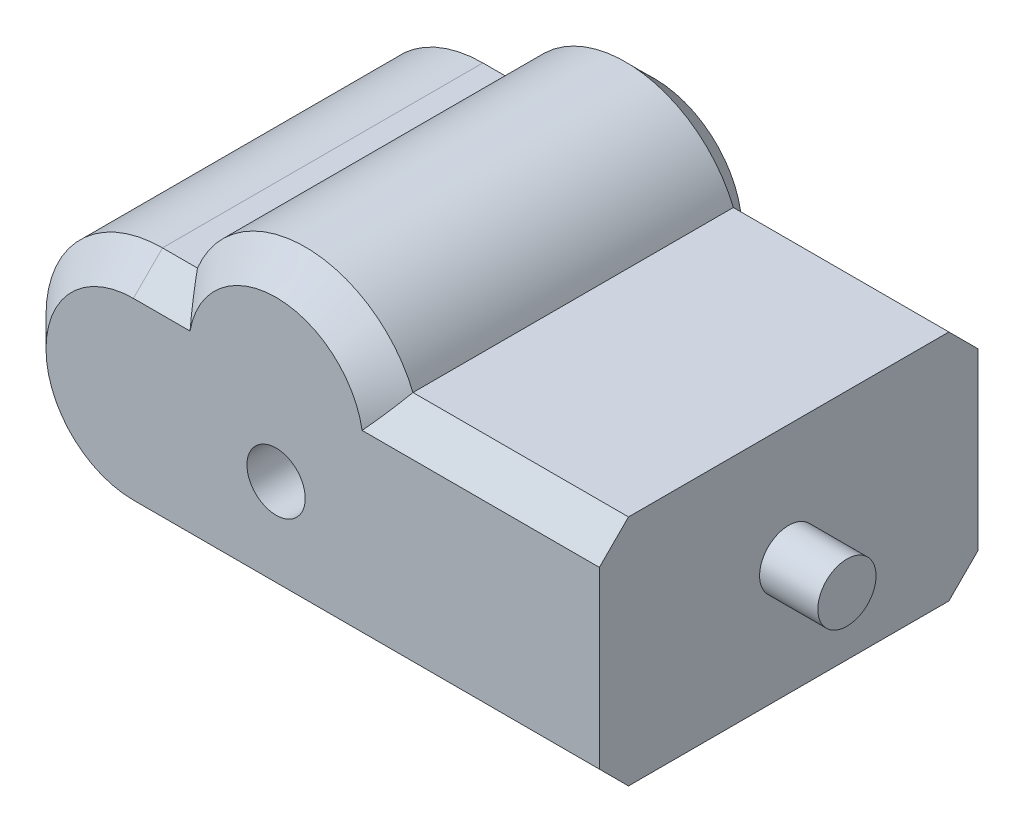
ISO-10303-21;
HEADER;
FILE_DESCRIPTION(('STEP AP214'),'2;1');
FILE_NAME('part.step','',(''),(''),'','','');
FILE_SCHEMA(('AUTOMOTIVE_DESIGN { 1 0 10303 214 1 1 1 1 }'));
ENDSEC;
DATA;
#1=APPLICATION_CONTEXT('core data for automotive mechanical design processes');
#2=APPLICATION_PROTOCOL_DEFINITION('international standard','automotive_design',2000,#1);
#3=PRODUCT_CONTEXT('',#1,'mechanical');
#4=PRODUCT('Part','Part','',(#3));
#5=PRODUCT_RELATED_PRODUCT_CATEGORY('part','',(#4));
#6=PRODUCT_DEFINITION_FORMATION('','',#4);
#7=PRODUCT_DEFINITION_CONTEXT('part definition',#1,'design');
#8=PRODUCT_DEFINITION('design','',#6,#7);
#9=PRODUCT_DEFINITION_SHAPE('','',#8);
#10=(LENGTH_UNIT() NAMED_UNIT(*) SI_UNIT(.MILLI.,.METRE.));
#11=(NAMED_UNIT(*) PLANE_ANGLE_UNIT() SI_UNIT($,.RADIAN.));
#12=(NAMED_UNIT(*) SI_UNIT($,.STERADIAN.) SOLID_ANGLE_UNIT());
#13=UNCERTAINTY_MEASURE_WITH_UNIT(LENGTH_MEASURE(1.E-05),#10,'distance_accuracy_value','');
#14=(GEOMETRIC_REPRESENTATION_CONTEXT(3) GLOBAL_UNCERTAINTY_ASSIGNED_CONTEXT((#13)) GLOBAL_UNIT_ASSIGNED_CONTEXT((#10,
#11,#12)) REPRESENTATION_CONTEXT('',''));
#15=CARTESIAN_POINT('',(0.,0.,0.));
#16=DIRECTION('',(0.,0.,1.));
#17=DIRECTION('',(1.,0.,0.));
#18=AXIS2_PLACEMENT_3D('',#15,#16,#17);
#19=CARTESIAN_POINT('',(-32.5714285714286,-20.,32.5));
#20=DIRECTION('',(0.,0.,-1.));
#21=DIRECTION('',(-1.,0.,0.));
#22=AXIS2_PLACEMENT_3D('',#19,#20,#21);
#23=CYLINDRICAL_SURFACE('',#22,20.);
#24=DIRECTION('',(0.,0.,-1.));
#25=VECTOR('',#24,1.);
#26=CARTESIAN_POINT('',(-32.5714285714286,0.,32.5));
#27=LINE('',#26,#25);
#28=CARTESIAN_POINT('',(-32.5714285714286,0.,27.5));
#29=VERTEX_POINT('',#28);
#30=CARTESIAN_POINT('',(-32.5714285714286,0.,-27.5));
#31=VERTEX_POINT('',#30);
#32=EDGE_CURVE('E303',#29,#31,#27,.T.);
#33=ORIENTED_EDGE('',*,*,#32,.T.);
#34=CARTESIAN_POINT('',(-32.5714285714286,-20.,-27.5));
#35=DIRECTION('',(0.,0.,-1.));
#36=DIRECTION('',(-1.,0.,0.));
#37=AXIS2_PLACEMENT_3D('',#34,#35,#36);
#38=CIRCLE('',#37,20.);
#39=CARTESIAN_POINT('',(-32.5714285714286,-40.,-27.5));
#40=VERTEX_POINT('',#39);
#41=EDGE_CURVE('E176',#31,#40,#38,.F.);
#42=ORIENTED_EDGE('',*,*,#41,.T.);
#43=DIRECTION('',(0.,0.,-1.));
#44=VECTOR('',#43,1.);
#45=CARTESIAN_POINT('',(-32.5714285714286,-40.,32.5));
#46=LINE('',#45,#44);
#47=CARTESIAN_POINT('',(-32.5714285714286,-40.,27.5));
#48=VERTEX_POINT('',#47);
#49=EDGE_CURVE('E150',#48,#40,#46,.T.);
#50=ORIENTED_EDGE('',*,*,#49,.F.);
#51=CARTESIAN_POINT('',(-32.5714285714286,-20.,27.5));
#52=DIRECTION('',(0.,0.,-1.));
#53=DIRECTION('',(-1.,0.,0.));
#54=AXIS2_PLACEMENT_3D('',#51,#52,#53);
#55=CIRCLE('',#54,20.);
#56=EDGE_CURVE('E174',#48,#29,#55,.T.);
#57=ORIENTED_EDGE('',*,*,#56,.T.);
#58=EDGE_LOOP('',(#33,#42,#50,#57));
#59=FACE_BOUND('',#58,.T.);
#60=ADVANCED_FACE('F39',(#59),#23,.T.);
#61=CARTESIAN_POINT('',(47.4285714285714,-40.,32.5));
#62=DIRECTION('',(0.,1.,0.));
#63=DIRECTION('',(-1.,0.,0.));
#64=AXIS2_PLACEMENT_3D('',#61,#62,#63);
#65=PLANE('',#64);
#66=ORIENTED_EDGE('',*,*,#49,.T.);
#67=DIRECTION('',(1.,0.,0.));
#68=VECTOR('',#67,1.);
#69=CARTESIAN_POINT('',(47.4285714285714,-40.,-27.5));
#70=LINE('',#69,#68);
#71=CARTESIAN_POINT('',(47.4285714285714,-40.,-27.5));
#72=VERTEX_POINT('',#71);
#73=EDGE_CURVE('E149',#40,#72,#70,.T.);
#74=ORIENTED_EDGE('',*,*,#73,.T.);
#75=DIRECTION('',(0.,0.,-1.));
#76=VECTOR('',#75,1.);
#77=CARTESIAN_POINT('',(47.4285714285714,-40.,32.5));
#78=LINE('',#77,#76);
#79=CARTESIAN_POINT('',(47.4285714285714,-40.,27.5));
#80=VERTEX_POINT('',#79);
#81=EDGE_CURVE('E133',#80,#72,#78,.T.);
#82=ORIENTED_EDGE('',*,*,#81,.F.);
#83=DIRECTION('',(-1.,0.,0.));
#84=VECTOR('',#83,1.);
#85=CARTESIAN_POINT('',(47.4285714285714,-40.,27.5));
#86=LINE('',#85,#84);
#87=EDGE_CURVE('E146',#80,#48,#86,.T.);
#88=ORIENTED_EDGE('',*,*,#87,.T.);
#89=EDGE_LOOP('',(#66,#74,#82,#88));
#90=FACE_BOUND('',#89,.T.);
#91=ADVANCED_FACE('F145',(#90),#65,.F.);
#92=CARTESIAN_POINT('',(47.4285714285713,0.,32.5));
#93=DIRECTION('',(-1.,0.,0.));
#94=DIRECTION('',(0.,-1.,0.));
#95=AXIS2_PLACEMENT_3D('',#92,#93,#94);
#96=PLANE('',#95);
#97=CARTESIAN_POINT('',(47.4285714285713,-20.,0.));
#98=DIRECTION('',(-1.,0.,0.));
#99=DIRECTION('',(0.,-1.,0.));
#100=AXIS2_PLACEMENT_3D('',#97,#98,#99);
#101=CIRCLE('',#100,5.);
#102=CARTESIAN_POINT('',(47.4285714285713,-25.,0.));
#103=VERTEX_POINT('',#102);
#104=EDGE_CURVE('E11',#103,#103,#101,.F.);
#105=ORIENTED_EDGE('',*,*,#104,.F.);
#106=EDGE_LOOP('',(#105));
#107=FACE_BOUND('',#106,.T.);
#108=ORIENTED_EDGE('',*,*,#81,.T.);
#109=DIRECTION('',(0.,0.70710678118655,-0.707106781186546));
#110=VECTOR('',#109,1.);
#111=CARTESIAN_POINT('',(47.4285714285714,-40.,-27.5));
#112=LINE('',#111,#110);
#113=CARTESIAN_POINT('',(47.4285714285714,-35.,-32.5));
#114=VERTEX_POINT('',#113);
#115=EDGE_CURVE('E162',#72,#114,#112,.T.);
#116=ORIENTED_EDGE('',*,*,#115,.T.);
#117=DIRECTION('',(0.,1.,0.));
#118=VECTOR('',#117,1.);
#119=CARTESIAN_POINT('',(47.4285714285713,0.,-32.5));
#120=LINE('',#119,#118);
#121=CARTESIAN_POINT('',(47.4285714285713,-5.00000000000002,-32.5));
#122=VERTEX_POINT('',#121);
#123=EDGE_CURVE('E306',#114,#122,#120,.T.);
#124=ORIENTED_EDGE('',*,*,#123,.T.);
#125=DIRECTION('',(0.,0.70710678118655,0.707106781186546));
#126=VECTOR('',#125,1.);
#127=CARTESIAN_POINT('',(47.4285714285713,0.,-27.5));
#128=LINE('',#127,#126);
#129=CARTESIAN_POINT('',(47.4285714285713,0.,-27.5));
#130=VERTEX_POINT('',#129);
#131=EDGE_CURVE('E139',#122,#130,#128,.T.);
#132=ORIENTED_EDGE('',*,*,#131,.T.);
#133=DIRECTION('',(0.,0.,-1.));
#134=VECTOR('',#133,1.);
#135=CARTESIAN_POINT('',(47.4285714285713,0.,32.5));
#136=LINE('',#135,#134);
#137=CARTESIAN_POINT('',(47.4285714285713,0.,27.5));
#138=VERTEX_POINT('',#137);
#139=EDGE_CURVE('E151',#138,#130,#136,.T.);
#140=ORIENTED_EDGE('',*,*,#139,.F.);
#141=DIRECTION('',(0.,0.707106781186546,-0.707106781186549));
#142=VECTOR('',#141,1.);
#143=CARTESIAN_POINT('',(47.4285714285713,-4.99999999999999,32.5));
#144=LINE('',#143,#142);
#145=CARTESIAN_POINT('',(47.4285714285713,-5.,32.5));
#146=VERTEX_POINT('',#145);
#147=EDGE_CURVE('E140',#138,#146,#144,.F.);
#148=ORIENTED_EDGE('',*,*,#147,.T.);
#149=DIRECTION('',(0.,1.,0.));
#150=VECTOR('',#149,1.);
#151=CARTESIAN_POINT('',(47.4285714285713,0.,32.5));
#152=LINE('',#151,#150);
#153=CARTESIAN_POINT('',(47.4285714285714,-35.,32.5));
#154=VERTEX_POINT('',#153);
#155=EDGE_CURVE('E135',#154,#146,#152,.T.);
#156=ORIENTED_EDGE('',*,*,#155,.F.);
#157=DIRECTION('',(0.,0.707106781186546,0.707106781186549));
#158=VECTOR('',#157,1.);
#159=CARTESIAN_POINT('',(47.4285714285714,-35.,32.5));
#160=LINE('',#159,#158);
#161=EDGE_CURVE('E130',#154,#80,#160,.F.);
#162=ORIENTED_EDGE('',*,*,#161,.T.);
#163=EDGE_LOOP('',(#108,#116,#124,#132,#140,#148,#156,#162));
#164=FACE_BOUND('',#163,.T.);
#165=ADVANCED_FACE('F132',(#107,#164),#96,.F.);
#166=CARTESIAN_POINT('',(10.4285714285713,0.,32.5));
#167=DIRECTION('',(0.,-1.,0.));
#168=DIRECTION('',(0.,0.,-1.));
#169=AXIS2_PLACEMENT_3D('',#166,#167,#168);
#170=PLANE('',#169);
#171=ORIENTED_EDGE('',*,*,#139,.T.);
#172=DIRECTION('',(-1.,0.,0.));
#173=VECTOR('',#172,1.);
#174=CARTESIAN_POINT('',(10.4285714285713,0.,-27.5));
#175=LINE('',#174,#173);
#176=CARTESIAN_POINT('',(10.4285714285713,0.,-27.5));
#177=VERTEX_POINT('',#176);
#178=EDGE_CURVE('E188',#130,#177,#175,.T.);
#179=ORIENTED_EDGE('',*,*,#178,.T.);
#180=DIRECTION('',(0.,0.,-1.));
#181=VECTOR('',#180,1.);
#182=CARTESIAN_POINT('',(10.4285714285713,0.,32.5));
#183=LINE('',#182,#181);
#184=CARTESIAN_POINT('',(10.4285714285713,0.,27.5));
#185=VERTEX_POINT('',#184);
#186=EDGE_CURVE('E294',#185,#177,#183,.T.);
#187=ORIENTED_EDGE('',*,*,#186,.F.);
#188=DIRECTION('',(1.,0.,0.));
#189=VECTOR('',#188,1.);
#190=CARTESIAN_POINT('',(10.4285714285713,0.,27.5));
#191=LINE('',#190,#189);
#192=EDGE_CURVE('E186',#185,#138,#191,.T.);
#193=ORIENTED_EDGE('',*,*,#192,.T.);
#194=EDGE_LOOP('',(#171,#179,#187,#193));
#195=FACE_BOUND('',#194,.T.);
#196=ADVANCED_FACE('F291',(#195),#170,.F.);
#197=CARTESIAN_POINT('',(-8.07142857142866,-7.59934207678534,32.5));
#198=DIRECTION('',(0.,0.,-1.));
#199=DIRECTION('',(-1.,0.,0.));
#200=AXIS2_PLACEMENT_3D('',#197,#198,#199);
#201=CYLINDRICAL_SURFACE('',#200,20.);
#202=ORIENTED_EDGE('',*,*,#186,.T.);
#203=CARTESIAN_POINT('',(-8.07142857142866,-7.59934207678534,-27.5));
#204=DIRECTION('',(0.,0.,-1.));
#205=DIRECTION('',(-1.,0.,0.));
#206=AXIS2_PLACEMENT_3D('',#203,#204,#205);
#207=CIRCLE('',#206,20.);
#208=CARTESIAN_POINT('',(-26.5714285714287,0.,-27.5));
#209=VERTEX_POINT('',#208);
#210=EDGE_CURVE('E184',#177,#209,#207,.F.);
#211=ORIENTED_EDGE('',*,*,#210,.T.);
#212=DIRECTION('',(0.,0.,-1.));
#213=VECTOR('',#212,1.);
#214=CARTESIAN_POINT('',(-26.5714285714287,0.,32.5));
#215=LINE('',#214,#213);
#216=CARTESIAN_POINT('',(-26.5714285714287,0.,27.5));
#217=VERTEX_POINT('',#216);
#218=EDGE_CURVE('E298',#217,#209,#215,.T.);
#219=ORIENTED_EDGE('',*,*,#218,.F.);
#220=CARTESIAN_POINT('',(-8.07142857142866,-7.59934207678534,27.5));
#221=DIRECTION('',(0.,0.,-1.));
#222=DIRECTION('',(-1.,0.,0.));
#223=AXIS2_PLACEMENT_3D('',#220,#221,#222);
#224=CIRCLE('',#223,20.);
#225=EDGE_CURVE('E182',#217,#185,#224,.T.);
#226=ORIENTED_EDGE('',*,*,#225,.T.);
#227=EDGE_LOOP('',(#202,#211,#219,#226));
#228=FACE_BOUND('',#227,.T.);
#229=ADVANCED_FACE('F335',(#228),#201,.T.);
#230=CARTESIAN_POINT('',(-32.5714285714286,0.,32.5));
#231=DIRECTION('',(0.,-1.,0.));
#232=DIRECTION('',(0.,0.,-1.));
#233=AXIS2_PLACEMENT_3D('',#230,#231,#232);
#234=PLANE('',#233);
#235=ORIENTED_EDGE('',*,*,#218,.T.);
#236=DIRECTION('',(-1.,0.,0.));
#237=VECTOR('',#236,1.);
#238=CARTESIAN_POINT('',(-32.5714285714286,0.,-27.5));
#239=LINE('',#238,#237);
#240=EDGE_CURVE('E180',#209,#31,#239,.T.);
#241=ORIENTED_EDGE('',*,*,#240,.T.);
#242=ORIENTED_EDGE('',*,*,#32,.F.);
#243=DIRECTION('',(1.,0.,0.));
#244=VECTOR('',#243,1.);
#245=CARTESIAN_POINT('',(-32.5714285714286,0.,27.5));
#246=LINE('',#245,#244);
#247=EDGE_CURVE('E178',#29,#217,#246,.T.);
#248=ORIENTED_EDGE('',*,*,#247,.T.);
#249=EDGE_LOOP('',(#235,#241,#242,#248));
#250=FACE_BOUND('',#249,.T.);
#251=ADVANCED_FACE('F379',(#250),#234,.F.);
#252=CARTESIAN_POINT('',(-32.5714285714286,-20.,32.5));
#253=DIRECTION('',(0.,0.,-1.));
#254=DIRECTION('',(-1.,0.,0.));
#255=AXIS2_PLACEMENT_3D('',#252,#253,#254);
#256=PLANE('',#255);
#257=CARTESIAN_POINT('',(-8.07142857142866,-20.,32.5));
#258=DIRECTION('',(0.,0.,1.));
#259=DIRECTION('',(1.,0.,0.));
#260=AXIS2_PLACEMENT_3D('',#257,#258,#259);
#261=CIRCLE('',#260,5.);
#262=CARTESIAN_POINT('',(-3.07142857142866,-20.,32.5));
#263=VERTEX_POINT('',#262);
#264=EDGE_CURVE('E309',#263,#263,#261,.T.);
#265=ORIENTED_EDGE('',*,*,#264,.F.);
#266=EDGE_LOOP('',(#265));
#267=FACE_BOUND('',#266,.T.);
#268=CARTESIAN_POINT('',(-32.5714285714286,-20.,32.5));
#269=DIRECTION('',(0.,0.,-1.));
#270=DIRECTION('',(-1.,0.,0.));
#271=AXIS2_PLACEMENT_3D('',#268,#269,#270);
#272=CIRCLE('',#271,15.);
#273=CARTESIAN_POINT('',(-32.5714285714286,-5.,32.5));
#274=VERTEX_POINT('',#273);
#275=CARTESIAN_POINT('',(-32.5714285714286,-35.,32.5));
#276=VERTEX_POINT('',#275);
#277=EDGE_CURVE('E56',#274,#276,#272,.F.);
#278=ORIENTED_EDGE('',*,*,#277,.T.);
#279=DIRECTION('',(1.,0.,0.));
#280=VECTOR('',#279,1.);
#281=CARTESIAN_POINT('',(-32.5714285714286,-35.,32.5));
#282=LINE('',#281,#280);
#283=EDGE_CURVE('E49',#276,#154,#282,.T.);
#284=ORIENTED_EDGE('',*,*,#283,.T.);
#285=ORIENTED_EDGE('',*,*,#155,.T.);
#286=DIRECTION('',(-1.,0.,0.));
#287=VECTOR('',#286,1.);
#288=CARTESIAN_POINT('',(-32.5714285714286,-5.,32.5));
#289=LINE('',#288,#287);
#290=CARTESIAN_POINT('',(6.70163545631634,-5.,32.5));
#291=VERTEX_POINT('',#290);
#292=EDGE_CURVE('E190',#146,#291,#289,.T.);
#293=ORIENTED_EDGE('',*,*,#292,.T.);
#294=CARTESIAN_POINT('',(-8.07142857142866,-7.59934207678534,32.5));
#295=DIRECTION('',(0.,0.,-1.));
#296=DIRECTION('',(-1.,0.,0.));
#297=AXIS2_PLACEMENT_3D('',#294,#295,#296);
#298=CIRCLE('',#297,15.);
#299=CARTESIAN_POINT('',(-22.8444925991737,-5.,32.5));
#300=VERTEX_POINT('',#299);
#301=EDGE_CURVE('E192',#291,#300,#298,.F.);
#302=ORIENTED_EDGE('',*,*,#301,.T.);
#303=DIRECTION('',(-1.,0.,0.));
#304=VECTOR('',#303,1.);
#305=CARTESIAN_POINT('',(-32.5714285714286,-5.,32.5));
#306=LINE('',#305,#304);
#307=EDGE_CURVE('E61',#300,#274,#306,.T.);
#308=ORIENTED_EDGE('',*,*,#307,.T.);
#309=EDGE_LOOP('',(#278,#284,#285,#293,#302,#308));
#310=FACE_BOUND('',#309,.T.);
#311=ADVANCED_FACE('F384',(#267,#310),#256,.F.);
#312=CARTESIAN_POINT('',(-32.5714285714286,-20.,-32.5));
#313=DIRECTION('',(0.,0.,-1.));
#314=DIRECTION('',(-1.,0.,0.));
#315=AXIS2_PLACEMENT_3D('',#312,#313,#314);
#316=PLANE('',#315);
#317=ORIENTED_EDGE('',*,*,#123,.F.);
#318=DIRECTION('',(-1.,0.,0.));
#319=VECTOR('',#318,1.);
#320=CARTESIAN_POINT('',(-32.5714285714286,-35.,-32.5));
#321=LINE('',#320,#319);
#322=CARTESIAN_POINT('',(-32.5714285714286,-35.,-32.5));
#323=VERTEX_POINT('',#322);
#324=EDGE_CURVE('E172',#114,#323,#321,.T.);
#325=ORIENTED_EDGE('',*,*,#324,.T.);
#326=CARTESIAN_POINT('',(-32.5714285714286,-20.,-32.5));
#327=DIRECTION('',(0.,0.,-1.));
#328=DIRECTION('',(-1.,0.,0.));
#329=AXIS2_PLACEMENT_3D('',#326,#327,#328);
#330=CIRCLE('',#329,15.);
#331=CARTESIAN_POINT('',(-32.5714285714286,-5.00000000000002,-32.5));
#332=VERTEX_POINT('',#331);
#333=EDGE_CURVE('E170',#323,#332,#330,.T.);
#334=ORIENTED_EDGE('',*,*,#333,.T.);
#335=DIRECTION('',(1.,0.,0.));
#336=VECTOR('',#335,1.);
#337=CARTESIAN_POINT('',(-26.5714285714287,-5.00000000000002,-32.5));
#338=LINE('',#337,#336);
#339=CARTESIAN_POINT('',(-22.8444925991736,-5.00000000000002,-32.5));
#340=VERTEX_POINT('',#339);
#341=EDGE_CURVE('E168',#332,#340,#338,.T.);
#342=ORIENTED_EDGE('',*,*,#341,.T.);
#343=CARTESIAN_POINT('',(-8.07142857142866,-7.59934207678534,-32.5));
#344=DIRECTION('',(0.,0.,-1.));
#345=DIRECTION('',(-1.,0.,0.));
#346=AXIS2_PLACEMENT_3D('',#343,#344,#345);
#347=CIRCLE('',#346,15.);
#348=CARTESIAN_POINT('',(6.70163545631633,-5.00000000000002,-32.5));
#349=VERTEX_POINT('',#348);
#350=EDGE_CURVE('E166',#340,#349,#347,.T.);
#351=ORIENTED_EDGE('',*,*,#350,.T.);
#352=DIRECTION('',(1.,0.,0.));
#353=VECTOR('',#352,1.);
#354=CARTESIAN_POINT('',(47.4285714285713,-5.00000000000002,-32.5));
#355=LINE('',#354,#353);
#356=EDGE_CURVE('E164',#349,#122,#355,.T.);
#357=ORIENTED_EDGE('',*,*,#356,.T.);
#358=EDGE_LOOP('',(#317,#325,#334,#342,#351,#357));
#359=FACE_BOUND('',#358,.T.);
#360=ADVANCED_FACE('F239',(#359),#316,.T.);
#361=CARTESIAN_POINT('',(10.4285714285713,0.,-27.5));
#362=DIRECTION('',(0.,0.707106781186545,-0.707106781186549));
#363=DIRECTION('',(1.,0.,0.));
#364=AXIS2_PLACEMENT_3D('',#361,#362,#363);
#365=PLANE('',#364);
#366=ORIENTED_EDGE('',*,*,#131,.F.);
#367=ORIENTED_EDGE('',*,*,#356,.F.);
#368=CARTESIAN_POINT('',(6.70163545631633,-5.00000000000002,-32.5));
#369=CARTESIAN_POINT('',(6.87175073423274,-4.79733108961404,-32.297331089614));
#370=CARTESIAN_POINT('',(7.03969955904487,-4.59375977763127,-32.0937597776313));
#371=CARTESIAN_POINT('',(7.37152359386892,-4.18497156014633,-31.6849715601463));
#372=CARTESIAN_POINT('',(7.53539892935427,-3.97975470558904,-31.479754705589));
#373=CARTESIAN_POINT('',(8.02114336002521,-3.36207931086404,-30.862079310864));
#374=CARTESIAN_POINT('',(8.33731491464059,-2.94737566775521,-30.4473756677552));
#375=CARTESIAN_POINT('',(8.95615477671934,-2.113082603135,-29.613082603135));
#376=CARTESIAN_POINT('',(9.25882560388042,-1.69349411189263,-29.1934941118926));
#377=CARTESIAN_POINT('',(9.85229686990586,-0.84985724434936,-28.3498572443494));
#378=CARTESIAN_POINT('',(10.1430909029164,-0.425806612449986,-27.92580661245));
#379=CARTESIAN_POINT('',(10.4285714285713,0.,-27.5));
#380=B_SPLINE_CURVE_WITH_KNOTS('',3,(#368,#369,#370,#371,#372,#373,#374,#375,#376,#377,#378,
#379),.UNSPECIFIED.,.F.,.F.,(4,2,2,2,2,4),(0.,0.999875382109055,1.99971992735593,
3.99832393930759,5.99655336915382,7.99584670012729),.UNSPECIFIED.);
#381=EDGE_CURVE('E213',#177,#349,#380,.F.);
#382=ORIENTED_EDGE('',*,*,#381,.F.);
#383=ORIENTED_EDGE('',*,*,#178,.F.);
#384=EDGE_LOOP('',(#366,#367,#382,#383));
#385=FACE_BOUND('',#384,.T.);
#386=ADVANCED_FACE('F231',(#385),#365,.T.);
#387=CARTESIAN_POINT('',(-8.07142857142866,-7.59934207678534,-27.5));
#388=DIRECTION('',(0.,0.,1.));
#389=DIRECTION('',(1.,0.,0.));
#390=AXIS2_PLACEMENT_3D('',#387,#388,#389);
#391=CONICAL_SURFACE('',#390,20.,0.785398163397451);
#392=ORIENTED_EDGE('',*,*,#381,.T.);
#393=ORIENTED_EDGE('',*,*,#350,.F.);
#394=CARTESIAN_POINT('',(-22.8444925991736,-5.00000000000002,-32.5));
#395=CARTESIAN_POINT('',(-23.0146078770901,-4.79733108961404,-32.297331089614));
#396=CARTESIAN_POINT('',(-23.1825567019022,-4.59375977763127,-32.0937597776313));
#397=CARTESIAN_POINT('',(-23.5143807367262,-4.18497156014633,-31.6849715601463));
#398=CARTESIAN_POINT('',(-23.6782560722116,-3.97975470558904,-31.479754705589));
#399=CARTESIAN_POINT('',(-24.1640005028825,-3.36207931086404,-30.862079310864));
#400=CARTESIAN_POINT('',(-24.4801720574979,-2.94737566775521,-30.4473756677552));
#401=CARTESIAN_POINT('',(-25.0990119195766,-2.113082603135,-29.613082603135));
#402=CARTESIAN_POINT('',(-25.4016827467377,-1.69349411189263,-29.1934941118926));
#403=CARTESIAN_POINT('',(-25.9951540127632,-0.849857244349362,-28.3498572443494));
#404=CARTESIAN_POINT('',(-26.2859480457737,-0.425806612449988,-27.92580661245));
#405=CARTESIAN_POINT('',(-26.5714285714287,0.,-27.5));
#406=B_SPLINE_CURVE_WITH_KNOTS('',3,(#394,#395,#396,#397,#398,#399,#400,#401,#402,#403,#404,
#405),.UNSPECIFIED.,.F.,.F.,(4,2,2,2,2,4),(0.,0.999875382109054,1.99971992735592,
3.99832393930759,5.99655336915381,7.99584670012728),.UNSPECIFIED.);
#407=EDGE_CURVE('E204',#209,#340,#406,.F.);
#408=ORIENTED_EDGE('',*,*,#407,.F.);
#409=ORIENTED_EDGE('',*,*,#210,.F.);
#410=EDGE_LOOP('',(#392,#393,#408,#409));
#411=FACE_BOUND('',#410,.T.);
#412=ADVANCED_FACE('F225',(#411),#391,.T.);
#413=CARTESIAN_POINT('',(-32.5714285714286,0.,-27.5));
#414=DIRECTION('',(0.,0.707106781186545,-0.707106781186549));
#415=DIRECTION('',(1.,0.,0.));
#416=AXIS2_PLACEMENT_3D('',#413,#414,#415);
#417=PLANE('',#416);
#418=ORIENTED_EDGE('',*,*,#407,.T.);
#419=ORIENTED_EDGE('',*,*,#341,.F.);
#420=DIRECTION('',(0.,-0.70710678118655,-0.707106781186545));
#421=VECTOR('',#420,1.);
#422=CARTESIAN_POINT('',(-32.5714285714286,0.,-27.5));
#423=LINE('',#422,#421);
#424=EDGE_CURVE('E200',#31,#332,#423,.T.);
#425=ORIENTED_EDGE('',*,*,#424,.F.);
#426=ORIENTED_EDGE('',*,*,#240,.F.);
#427=EDGE_LOOP('',(#418,#419,#425,#426));
#428=FACE_BOUND('',#427,.T.);
#429=ADVANCED_FACE('F221',(#428),#417,.T.);
#430=CARTESIAN_POINT('',(-32.5714285714286,-20.,-27.5));
#431=DIRECTION('',(0.,0.,1.));
#432=DIRECTION('',(1.,0.,0.));
#433=AXIS2_PLACEMENT_3D('',#430,#431,#432);
#434=CONICAL_SURFACE('',#433,20.,0.785398163397451);
#435=ORIENTED_EDGE('',*,*,#424,.T.);
#436=ORIENTED_EDGE('',*,*,#333,.F.);
#437=DIRECTION('',(0.,0.707106781186549,-0.707106781186545));
#438=VECTOR('',#437,1.);
#439=CARTESIAN_POINT('',(-32.5714285714286,-40.,-27.5));
#440=LINE('',#439,#438);
#441=EDGE_CURVE('E197',#40,#323,#440,.T.);
#442=ORIENTED_EDGE('',*,*,#441,.F.);
#443=ORIENTED_EDGE('',*,*,#41,.F.);
#444=EDGE_LOOP('',(#435,#436,#442,#443));
#445=FACE_BOUND('',#444,.T.);
#446=ADVANCED_FACE('F351',(#445),#434,.T.);
#447=CARTESIAN_POINT('',(47.4285714285714,-40.,-27.5));
#448=DIRECTION('',(0.,-0.707106781186545,-0.707106781186549));
#449=DIRECTION('',(-1.,0.,0.));
#450=AXIS2_PLACEMENT_3D('',#447,#448,#449);
#451=PLANE('',#450);
#452=ORIENTED_EDGE('',*,*,#441,.T.);
#453=ORIENTED_EDGE('',*,*,#324,.F.);
#454=ORIENTED_EDGE('',*,*,#115,.F.);
#455=ORIENTED_EDGE('',*,*,#73,.F.);
#456=EDGE_LOOP('',(#452,#453,#454,#455));
#457=FACE_BOUND('',#456,.T.);
#458=ADVANCED_FACE('F346',(#457),#451,.T.);
#459=CARTESIAN_POINT('',(-32.5714285714286,-5.,32.5));
#460=DIRECTION('',(0.,-0.707106781186549,-0.707106781186545));
#461=DIRECTION('',(-1.,0.,0.));
#462=AXIS2_PLACEMENT_3D('',#459,#460,#461);
#463=PLANE('',#462);
#464=ORIENTED_EDGE('',*,*,#147,.F.);
#465=ORIENTED_EDGE('',*,*,#192,.F.);
#466=CARTESIAN_POINT('',(10.4285714285713,0.,27.5));
#467=CARTESIAN_POINT('',(10.1430909029164,-0.425806612449984,27.92580661245));
#468=CARTESIAN_POINT('',(9.85229686990587,-0.849857244349357,28.3498572443493));
#469=CARTESIAN_POINT('',(9.25882560388042,-1.69349411189263,29.1934941118926));
#470=CARTESIAN_POINT('',(8.95615477671934,-2.113082603135,29.613082603135));
#471=CARTESIAN_POINT('',(8.33731491464059,-2.9473756677552,30.4473756677552));
#472=CARTESIAN_POINT('',(8.02114336002522,-3.36207931086403,30.862079310864));
#473=CARTESIAN_POINT('',(7.53539892935427,-3.97975470558903,31.479754705589));
#474=CARTESIAN_POINT('',(7.37152359386893,-4.18497156014632,31.6849715601463));
#475=CARTESIAN_POINT('',(7.03969955904487,-4.59375977763126,32.0937597776313));
#476=CARTESIAN_POINT('',(6.87175073423275,-4.79733108961402,32.297331089614));
#477=CARTESIAN_POINT('',(6.70163545631634,-5.00000000000001,32.5));
#478=B_SPLINE_CURVE_WITH_KNOTS('',3,(#466,#467,#468,#469,#470,#471,#472,#473,#474,#475,#476,
#477),.UNSPECIFIED.,.F.,.F.,(4,2,2,2,2,4),(0.,1.99929333097347,3.9975227608197,5.99612677277137,
6.99597131801824,7.9958467001273),.UNSPECIFIED.);
#479=EDGE_CURVE('E201',#291,#185,#478,.F.);
#480=ORIENTED_EDGE('',*,*,#479,.F.);
#481=ORIENTED_EDGE('',*,*,#292,.F.);
#482=EDGE_LOOP('',(#464,#465,#480,#481));
#483=FACE_BOUND('',#482,.T.);
#484=ADVANCED_FACE('F42',(#483),#463,.F.);
#485=CARTESIAN_POINT('',(-8.07142857142866,-7.59934207678534,32.5));
#486=DIRECTION('',(0.,0.,-1.));
#487=DIRECTION('',(-1.,0.,0.));
#488=AXIS2_PLACEMENT_3D('',#485,#486,#487);
#489=CONICAL_SURFACE('',#488,15.,0.785398163397446);
#490=ORIENTED_EDGE('',*,*,#479,.T.);
#491=ORIENTED_EDGE('',*,*,#225,.F.);
#492=CARTESIAN_POINT('',(-26.5714285714287,0.,27.5));
#493=CARTESIAN_POINT('',(-26.2859480457737,-0.425806612449985,27.92580661245));
#494=CARTESIAN_POINT('',(-25.9951540127632,-0.849857244349357,28.3498572443493));
#495=CARTESIAN_POINT('',(-25.4016827467377,-1.69349411189263,29.1934941118926));
#496=CARTESIAN_POINT('',(-25.0990119195767,-2.113082603135,29.613082603135));
#497=CARTESIAN_POINT('',(-24.4801720574979,-2.9473756677552,30.4473756677552));
#498=CARTESIAN_POINT('',(-24.1640005028825,-3.36207931086403,30.862079310864));
#499=CARTESIAN_POINT('',(-23.6782560722116,-3.97975470558903,31.479754705589));
#500=CARTESIAN_POINT('',(-23.5143807367262,-4.18497156014632,31.6849715601463));
#501=CARTESIAN_POINT('',(-23.1825567019022,-4.59375977763126,32.0937597776313));
#502=CARTESIAN_POINT('',(-23.0146078770901,-4.79733108961403,32.297331089614));
#503=CARTESIAN_POINT('',(-22.8444925991737,-5.00000000000001,32.5));
#504=B_SPLINE_CURVE_WITH_KNOTS('',3,(#492,#493,#494,#495,#496,#497,#498,#499,#500,#501,#502,
#503),.UNSPECIFIED.,.F.,.F.,(4,2,2,2,2,4),(0.,1.99929333097347,3.9975227608197,5.99612677277137,
6.99597131801824,7.9958467001273),.UNSPECIFIED.);
#505=EDGE_CURVE('E265',#300,#217,#504,.F.);
#506=ORIENTED_EDGE('',*,*,#505,.F.);
#507=ORIENTED_EDGE('',*,*,#301,.F.);
#508=EDGE_LOOP('',(#490,#491,#506,#507));
#509=FACE_BOUND('',#508,.T.);
#510=ADVANCED_FACE('F261',(#509),#489,.T.);
#511=CARTESIAN_POINT('',(-32.5714285714286,-5.,32.5));
#512=DIRECTION('',(0.,-0.707106781186549,-0.707106781186545));
#513=DIRECTION('',(-1.,0.,0.));
#514=AXIS2_PLACEMENT_3D('',#511,#512,#513);
#515=PLANE('',#514);
#516=ORIENTED_EDGE('',*,*,#505,.T.);
#517=ORIENTED_EDGE('',*,*,#247,.F.);
#518=DIRECTION('',(0.,0.707106781186545,-0.707106781186549));
#519=VECTOR('',#518,1.);
#520=CARTESIAN_POINT('',(-32.5714285714286,-5.,32.5));
#521=LINE('',#520,#519);
#522=EDGE_CURVE('E272',#274,#29,#521,.T.);
#523=ORIENTED_EDGE('',*,*,#522,.F.);
#524=ORIENTED_EDGE('',*,*,#307,.F.);
#525=EDGE_LOOP('',(#516,#517,#523,#524));
#526=FACE_BOUND('',#525,.T.);
#527=ADVANCED_FACE('F254',(#526),#515,.F.);
#528=CARTESIAN_POINT('',(-32.5714285714286,-20.,32.5));
#529=DIRECTION('',(0.,0.,-1.));
#530=DIRECTION('',(-1.,0.,0.));
#531=AXIS2_PLACEMENT_3D('',#528,#529,#530);
#532=CONICAL_SURFACE('',#531,15.,0.785398163397446);
#533=ORIENTED_EDGE('',*,*,#522,.T.);
#534=ORIENTED_EDGE('',*,*,#56,.F.);
#535=DIRECTION('',(0.,-0.707106781186545,-0.70710678118655));
#536=VECTOR('',#535,1.);
#537=CARTESIAN_POINT('',(-32.5714285714286,-35.,32.5));
#538=LINE('',#537,#536);
#539=EDGE_CURVE('E155',#276,#48,#538,.T.);
#540=ORIENTED_EDGE('',*,*,#539,.F.);
#541=ORIENTED_EDGE('',*,*,#277,.F.);
#542=EDGE_LOOP('',(#533,#534,#540,#541));
#543=FACE_BOUND('',#542,.T.);
#544=ADVANCED_FACE('F248',(#543),#532,.T.);
#545=CARTESIAN_POINT('',(-32.5714285714286,-35.,32.5));
#546=DIRECTION('',(0.,0.707106781186549,-0.707106781186545));
#547=DIRECTION('',(1.,0.,0.));
#548=AXIS2_PLACEMENT_3D('',#545,#546,#547);
#549=PLANE('',#548);
#550=ORIENTED_EDGE('',*,*,#539,.T.);
#551=ORIENTED_EDGE('',*,*,#87,.F.);
#552=ORIENTED_EDGE('',*,*,#161,.F.);
#553=ORIENTED_EDGE('',*,*,#283,.F.);
#554=EDGE_LOOP('',(#550,#551,#552,#553));
#555=FACE_BOUND('',#554,.T.);
#556=ADVANCED_FACE('F154',(#555),#549,.F.);
#557=CARTESIAN_POINT('',(-8.07142857142866,-20.,22.5));
#558=DIRECTION('',(0.,0.,1.));
#559=DIRECTION('',(1.,0.,0.));
#560=AXIS2_PLACEMENT_3D('',#557,#558,#559);
#561=CYLINDRICAL_SURFACE('',#560,5.);
#562=CARTESIAN_POINT('',(-8.07142857142866,-20.,22.5));
#563=DIRECTION('',(0.,0.,1.));
#564=DIRECTION('',(1.,0.,0.));
#565=AXIS2_PLACEMENT_3D('',#562,#563,#564);
#566=CIRCLE('',#565,5.);
#567=CARTESIAN_POINT('',(-3.07142857142866,-20.,22.5));
#568=VERTEX_POINT('',#567);
#569=EDGE_CURVE('E312',#568,#568,#566,.T.);
#570=ORIENTED_EDGE('',*,*,#569,.F.);
#571=EDGE_LOOP('',(#570));
#572=FACE_BOUND('',#571,.T.);
#573=ORIENTED_EDGE('',*,*,#264,.T.);
#574=EDGE_LOOP('',(#573));
#575=FACE_BOUND('',#574,.T.);
#576=ADVANCED_FACE('F247',(#572,#575),#561,.F.);
#577=CARTESIAN_POINT('',(-8.07142857142866,-20.,22.5));
#578=DIRECTION('',(0.,0.,1.));
#579=DIRECTION('',(1.,0.,0.));
#580=AXIS2_PLACEMENT_3D('',#577,#578,#579);
#581=PLANE('',#580);
#582=ORIENTED_EDGE('',*,*,#569,.T.);
#583=EDGE_LOOP('',(#582));
#584=FACE_BOUND('',#583,.T.);
#585=ADVANCED_FACE('F324',(#584),#581,.T.);
#586=CARTESIAN_POINT('',(57.4285714285714,-20.,0.));
#587=DIRECTION('',(-1.,0.,0.));
#588=DIRECTION('',(0.,-1.,0.));
#589=AXIS2_PLACEMENT_3D('',#586,#587,#588);
#590=CYLINDRICAL_SURFACE('',#589,5.);
#591=CARTESIAN_POINT('',(57.4285714285714,-20.,0.));
#592=DIRECTION('',(1.,0.,0.));
#593=DIRECTION('',(0.,1.,0.));
#594=AXIS2_PLACEMENT_3D('',#591,#592,#593);
#595=CIRCLE('',#594,5.);
#596=CARTESIAN_POINT('',(57.4285714285714,-15.,0.));
#597=VERTEX_POINT('',#596);
#598=EDGE_CURVE('E313',#597,#597,#595,.T.);
#599=ORIENTED_EDGE('',*,*,#598,.F.);
#600=EDGE_LOOP('',(#599));
#601=FACE_BOUND('',#600,.T.);
#602=ORIENTED_EDGE('',*,*,#104,.T.);
#603=EDGE_LOOP('',(#602));
#604=FACE_BOUND('',#603,.T.);
#605=ADVANCED_FACE('F321',(#601,#604),#590,.T.);
#606=CARTESIAN_POINT('',(57.4285714285714,-20.,0.));
#607=DIRECTION('',(1.,0.,0.));
#608=DIRECTION('',(0.,1.,0.));
#609=AXIS2_PLACEMENT_3D('',#606,#607,#608);
#610=PLANE('',#609);
#611=ORIENTED_EDGE('',*,*,#598,.T.);
#612=EDGE_LOOP('',(#611));
#613=FACE_BOUND('',#612,.T.);
#614=ADVANCED_FACE('F319',(#613),#610,.T.);
#615=CLOSED_SHELL('',(#60,#91,#165,#196,#229,#251,#311,#360,#386,#412,#429,#446,#458,#484,#510,
#527,#544,#556,#576,#585,#605,#614));
#616=MANIFOLD_SOLID_BREP('B2',#615);
#617=ADVANCED_BREP_SHAPE_REPRESENTATION('',(#18,#616),#14);
#618=SHAPE_DEFINITION_REPRESENTATION(#9,#617);
ENDSEC;
END-ISO-10303-21;
